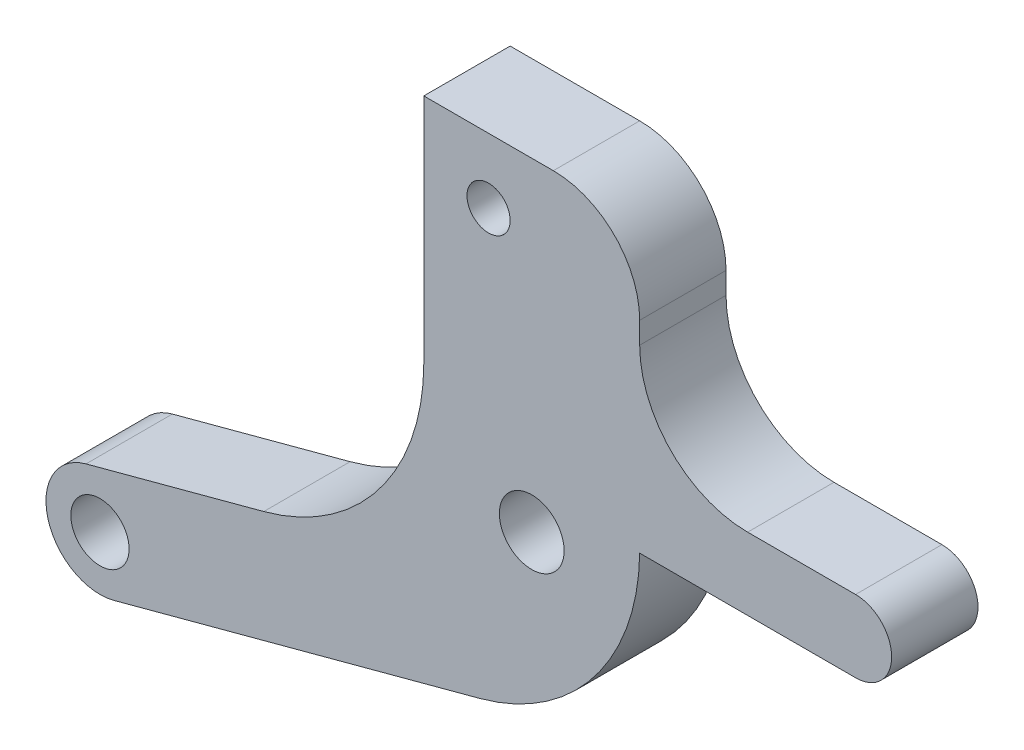
ISO-10303-21;
HEADER;
FILE_DESCRIPTION(('STEP AP214'),'2;1');
FILE_NAME('part.step','',(''),(''),'','','');
FILE_SCHEMA(('AUTOMOTIVE_DESIGN { 1 0 10303 214 1 1 1 1 }'));
ENDSEC;
DATA;
#1=APPLICATION_CONTEXT('core data for automotive mechanical design processes');
#2=APPLICATION_PROTOCOL_DEFINITION('international standard','automotive_design',2000,#1);
#3=PRODUCT_CONTEXT('',#1,'mechanical');
#4=PRODUCT('Part','Part','',(#3));
#5=PRODUCT_RELATED_PRODUCT_CATEGORY('part','',(#4));
#6=PRODUCT_DEFINITION_FORMATION('','',#4);
#7=PRODUCT_DEFINITION_CONTEXT('part definition',#1,'design');
#8=PRODUCT_DEFINITION('design','',#6,#7);
#9=PRODUCT_DEFINITION_SHAPE('','',#8);
#10=(LENGTH_UNIT() NAMED_UNIT(*) SI_UNIT(.MILLI.,.METRE.));
#11=(NAMED_UNIT(*) PLANE_ANGLE_UNIT() SI_UNIT($,.RADIAN.));
#12=(NAMED_UNIT(*) SI_UNIT($,.STERADIAN.) SOLID_ANGLE_UNIT());
#13=UNCERTAINTY_MEASURE_WITH_UNIT(LENGTH_MEASURE(1.E-05),#10,'distance_accuracy_value','');
#14=(GEOMETRIC_REPRESENTATION_CONTEXT(3) GLOBAL_UNCERTAINTY_ASSIGNED_CONTEXT((#13)) GLOBAL_UNIT_ASSIGNED_CONTEXT((#10,
#11,#12)) REPRESENTATION_CONTEXT('',''));
#15=CARTESIAN_POINT('',(0.,0.,0.));
#16=DIRECTION('',(0.,0.,1.));
#17=DIRECTION('',(1.,0.,0.));
#18=AXIS2_PLACEMENT_3D('',#15,#16,#17);
#19=CARTESIAN_POINT('',(15.,3.3293901031356,4.));
#20=DIRECTION('',(0.,0.,-1.));
#21=DIRECTION('',(-1.,0.,0.));
#22=AXIS2_PLACEMENT_3D('',#19,#20,#21);
#23=PLANE('',#22);
#24=CARTESIAN_POINT('',(-2.,12.,4.));
#25=DIRECTION('',(0.,0.,1.));
#26=DIRECTION('',(1.,0.,0.));
#27=AXIS2_PLACEMENT_3D('',#24,#25,#26);
#28=CIRCLE('',#27,1.);
#29=CARTESIAN_POINT('',(-1.,12.,4.));
#30=VERTEX_POINT('',#29);
#31=EDGE_CURVE('E427',#30,#30,#28,.T.);
#32=ORIENTED_EDGE('',*,*,#31,.F.);
#33=EDGE_LOOP('',(#32));
#34=FACE_BOUND('',#33,.T.);
#35=DIRECTION('',(0.,1.,0.));
#36=VECTOR('',#35,1.);
#37=CARTESIAN_POINT('',(5.,5.,4.));
#38=LINE('',#37,#36);
#39=CARTESIAN_POINT('',(5.,10.,4.));
#40=VERTEX_POINT('',#39);
#41=CARTESIAN_POINT('',(5.,11.,4.));
#42=VERTEX_POINT('',#41);
#43=EDGE_CURVE('E137',#40,#42,#38,.T.);
#44=ORIENTED_EDGE('',*,*,#43,.T.);
#45=CARTESIAN_POINT('',(0.999999999999999,11.,4.));
#46=DIRECTION('',(0.,0.,-1.));
#47=DIRECTION('',(-1.,0.,0.));
#48=AXIS2_PLACEMENT_3D('',#45,#46,#47);
#49=CIRCLE('',#48,4.);
#50=CARTESIAN_POINT('',(0.999999999999998,15.,4.));
#51=VERTEX_POINT('',#50);
#52=EDGE_CURVE('E11',#42,#51,#49,.F.);
#53=ORIENTED_EDGE('',*,*,#52,.T.);
#54=DIRECTION('',(-1.,0.,0.));
#55=VECTOR('',#54,1.);
#56=CARTESIAN_POINT('',(5.,15.,4.));
#57=LINE('',#56,#55);
#58=CARTESIAN_POINT('',(-5.,15.,4.));
#59=VERTEX_POINT('',#58);
#60=EDGE_CURVE('E191',#51,#59,#57,.T.);
#61=ORIENTED_EDGE('',*,*,#60,.T.);
#62=DIRECTION('',(0.,-1.,0.));
#63=VECTOR('',#62,1.);
#64=CARTESIAN_POINT('',(-5.,15.,4.));
#65=LINE('',#64,#63);
#66=CARTESIAN_POINT('',(-5.,4.28069821728162,4.));
#67=VERTEX_POINT('',#66);
#68=EDGE_CURVE('E256',#59,#67,#65,.T.);
#69=ORIENTED_EDGE('',*,*,#68,.T.);
#70=CARTESIAN_POINT('',(-15.,4.28069821728162,4.));
#71=DIRECTION('',(0.,0.,-1.));
#72=DIRECTION('',(-1.,0.,0.));
#73=AXIS2_PLACEMENT_3D('',#70,#71,#72);
#74=CIRCLE('',#73,10.);
#75=CARTESIAN_POINT('',(-12.4118095489748,-5.37856004560906,4.));
#76=VERTEX_POINT('',#75);
#77=EDGE_CURVE('E172',#67,#76,#74,.T.);
#78=ORIENTED_EDGE('',*,*,#77,.T.);
#79=DIRECTION('',(-0.965925826289069,-0.258819045102518,0.));
#80=VECTOR('',#79,1.);
#81=CARTESIAN_POINT('',(-5.,-3.392571662508,4.));
#82=LINE('',#81,#80);
#83=CARTESIAN_POINT('',(-20.6470476127563,-7.58518543427733,4.));
#84=VERTEX_POINT('',#83);
#85=EDGE_CURVE('E261',#76,#84,#82,.T.);
#86=ORIENTED_EDGE('',*,*,#85,.T.);
#87=CARTESIAN_POINT('',(-20.,-10.,4.));
#88=DIRECTION('',(0.,0.,1.));
#89=DIRECTION('',(1.,0.,0.));
#90=AXIS2_PLACEMENT_3D('',#87,#88,#89);
#91=CIRCLE('',#90,2.5);
#92=CARTESIAN_POINT('',(-19.3529523872437,-12.4148145657227,4.));
#93=VERTEX_POINT('',#92);
#94=EDGE_CURVE('E228',#84,#93,#91,.T.);
#95=ORIENTED_EDGE('',*,*,#94,.T.);
#96=DIRECTION('',(0.965925826289069,0.258819045102518,0.));
#97=VECTOR('',#96,1.);
#98=CARTESIAN_POINT('',(-19.3529523872437,-12.4148145657227,4.));
#99=LINE('',#98,#97);
#100=CARTESIAN_POINT('',(-2.41102527562674,-7.87523887793802,4.));
#101=VERTEX_POINT('',#100);
#102=EDGE_CURVE('E243',#93,#101,#99,.T.);
#103=ORIENTED_EDGE('',*,*,#102,.T.);
#104=CARTESIAN_POINT('',(-4.99921572665193,1.78401938495267,4.));
#105=DIRECTION('',(0.,0.,-1.));
#106=DIRECTION('',(-1.,0.,0.));
#107=AXIS2_PLACEMENT_3D('',#104,#105,#106);
#108=CIRCLE('',#107,10.);
#109=CARTESIAN_POINT('',(5.,1.65878020627119,4.));
#110=VERTEX_POINT('',#109);
#111=EDGE_CURVE('E163',#101,#110,#108,.F.);
#112=ORIENTED_EDGE('',*,*,#111,.T.);
#113=DIRECTION('',(1.,0.,0.));
#114=VECTOR('',#113,1.);
#115=CARTESIAN_POINT('',(5.,1.65878020627119,4.));
#116=LINE('',#115,#114);
#117=CARTESIAN_POINT('',(15.,1.65878020627119,4.));
#118=VERTEX_POINT('',#117);
#119=EDGE_CURVE('E143',#110,#118,#116,.T.);
#120=ORIENTED_EDGE('',*,*,#119,.T.);
#121=CARTESIAN_POINT('',(15.,3.3293901031356,4.));
#122=DIRECTION('',(0.,0.,1.));
#123=DIRECTION('',(-1.,0.,0.));
#124=AXIS2_PLACEMENT_3D('',#121,#122,#123);
#125=CIRCLE('',#124,1.6706098968644);
#126=CARTESIAN_POINT('',(15.,5.,4.));
#127=VERTEX_POINT('',#126);
#128=EDGE_CURVE('E138',#118,#127,#125,.T.);
#129=ORIENTED_EDGE('',*,*,#128,.T.);
#130=DIRECTION('',(-1.,0.,0.));
#131=VECTOR('',#130,1.);
#132=CARTESIAN_POINT('',(15.,5.,4.));
#133=LINE('',#132,#131);
#134=CARTESIAN_POINT('',(10.,5.,4.));
#135=VERTEX_POINT('',#134);
#136=EDGE_CURVE('E126',#127,#135,#133,.T.);
#137=ORIENTED_EDGE('',*,*,#136,.T.);
#138=CARTESIAN_POINT('',(10.,10.,4.));
#139=DIRECTION('',(0.,0.,-1.));
#140=DIRECTION('',(-1.,0.,0.));
#141=AXIS2_PLACEMENT_3D('',#138,#139,#140);
#142=CIRCLE('',#141,5.);
#143=EDGE_CURVE('E180',#135,#40,#142,.T.);
#144=ORIENTED_EDGE('',*,*,#143,.T.);
#145=EDGE_LOOP('',(#44,#53,#61,#69,#78,#86,#95,#103,#112,#120,#129,#137,#144));
#146=FACE_BOUND('',#145,.T.);
#147=CARTESIAN_POINT('',(0.,0.,4.));
#148=DIRECTION('',(0.,0.,1.));
#149=DIRECTION('',(1.,0.,0.));
#150=AXIS2_PLACEMENT_3D('',#147,#148,#149);
#151=CIRCLE('',#150,1.5);
#152=CARTESIAN_POINT('',(1.5,0.,4.));
#153=VERTEX_POINT('',#152);
#154=EDGE_CURVE('E250',#153,#153,#151,.T.);
#155=ORIENTED_EDGE('',*,*,#154,.F.);
#156=EDGE_LOOP('',(#155));
#157=FACE_BOUND('',#156,.T.);
#158=CARTESIAN_POINT('',(-20.,-10.,4.));
#159=DIRECTION('',(0.,0.,1.));
#160=DIRECTION('',(1.,0.,0.));
#161=AXIS2_PLACEMENT_3D('',#158,#159,#160);
#162=CIRCLE('',#161,1.35);
#163=CARTESIAN_POINT('',(-18.65,-10.,4.));
#164=VERTEX_POINT('',#163);
#165=EDGE_CURVE('E418',#164,#164,#162,.T.);
#166=ORIENTED_EDGE('',*,*,#165,.F.);
#167=EDGE_LOOP('',(#166));
#168=FACE_BOUND('',#167,.T.);
#169=ADVANCED_FACE('F31',(#34,#146,#157,#168),#23,.F.);
#170=CARTESIAN_POINT('',(15.,3.3293901031356,0.));
#171=DIRECTION('',(0.,0.,-1.));
#172=DIRECTION('',(-1.,0.,0.));
#173=AXIS2_PLACEMENT_3D('',#170,#171,#172);
#174=PLANE('',#173);
#175=CARTESIAN_POINT('',(-2.,12.,0.));
#176=DIRECTION('',(0.,0.,1.));
#177=DIRECTION('',(1.,0.,0.));
#178=AXIS2_PLACEMENT_3D('',#175,#176,#177);
#179=CIRCLE('',#178,1.);
#180=CARTESIAN_POINT('',(-1.,12.,0.));
#181=VERTEX_POINT('',#180);
#182=EDGE_CURVE('E424',#181,#181,#179,.T.);
#183=ORIENTED_EDGE('',*,*,#182,.T.);
#184=EDGE_LOOP('',(#183));
#185=FACE_BOUND('',#184,.T.);
#186=DIRECTION('',(-1.,0.,0.));
#187=VECTOR('',#186,1.);
#188=CARTESIAN_POINT('',(5.,15.,0.));
#189=LINE('',#188,#187);
#190=CARTESIAN_POINT('',(0.999999999999998,15.,0.));
#191=VERTEX_POINT('',#190);
#192=CARTESIAN_POINT('',(-5.,15.,0.));
#193=VERTEX_POINT('',#192);
#194=EDGE_CURVE('E190',#191,#193,#189,.T.);
#195=ORIENTED_EDGE('',*,*,#194,.F.);
#196=CARTESIAN_POINT('',(0.999999999999999,11.,0.));
#197=DIRECTION('',(0.,0.,-1.));
#198=DIRECTION('',(-1.,0.,0.));
#199=AXIS2_PLACEMENT_3D('',#196,#197,#198);
#200=CIRCLE('',#199,4.);
#201=CARTESIAN_POINT('',(5.,11.,0.));
#202=VERTEX_POINT('',#201);
#203=EDGE_CURVE('E53',#191,#202,#200,.T.);
#204=ORIENTED_EDGE('',*,*,#203,.T.);
#205=DIRECTION('',(0.,1.,0.));
#206=VECTOR('',#205,1.);
#207=CARTESIAN_POINT('',(5.,5.,0.));
#208=LINE('',#207,#206);
#209=CARTESIAN_POINT('',(5.,10.,0.));
#210=VERTEX_POINT('',#209);
#211=EDGE_CURVE('E199',#210,#202,#208,.T.);
#212=ORIENTED_EDGE('',*,*,#211,.F.);
#213=CARTESIAN_POINT('',(10.,10.,0.));
#214=DIRECTION('',(0.,0.,-1.));
#215=DIRECTION('',(-1.,0.,0.));
#216=AXIS2_PLACEMENT_3D('',#213,#214,#215);
#217=CIRCLE('',#216,5.);
#218=CARTESIAN_POINT('',(10.,5.,0.));
#219=VERTEX_POINT('',#218);
#220=EDGE_CURVE('E178',#210,#219,#217,.F.);
#221=ORIENTED_EDGE('',*,*,#220,.T.);
#222=DIRECTION('',(-1.,0.,0.));
#223=VECTOR('',#222,1.);
#224=CARTESIAN_POINT('',(15.,5.,0.));
#225=LINE('',#224,#223);
#226=CARTESIAN_POINT('',(15.,5.,0.));
#227=VERTEX_POINT('',#226);
#228=EDGE_CURVE('E203',#227,#219,#225,.T.);
#229=ORIENTED_EDGE('',*,*,#228,.F.);
#230=CARTESIAN_POINT('',(15.,3.3293901031356,0.));
#231=DIRECTION('',(0.,0.,1.));
#232=DIRECTION('',(-1.,0.,0.));
#233=AXIS2_PLACEMENT_3D('',#230,#231,#232);
#234=CIRCLE('',#233,1.6706098968644);
#235=CARTESIAN_POINT('',(15.,1.65878020627119,0.));
#236=VERTEX_POINT('',#235);
#237=EDGE_CURVE('E151',#236,#227,#234,.T.);
#238=ORIENTED_EDGE('',*,*,#237,.F.);
#239=DIRECTION('',(1.,0.,0.));
#240=VECTOR('',#239,1.);
#241=CARTESIAN_POINT('',(5.,1.65878020627119,0.));
#242=LINE('',#241,#240);
#243=CARTESIAN_POINT('',(5.,1.65878020627119,0.));
#244=VERTEX_POINT('',#243);
#245=EDGE_CURVE('E147',#244,#236,#242,.T.);
#246=ORIENTED_EDGE('',*,*,#245,.F.);
#247=CARTESIAN_POINT('',(-4.99921572665193,1.78401938495267,0.));
#248=DIRECTION('',(0.,0.,-1.));
#249=DIRECTION('',(-1.,0.,0.));
#250=AXIS2_PLACEMENT_3D('',#247,#248,#249);
#251=CIRCLE('',#250,10.);
#252=CARTESIAN_POINT('',(-2.41102527562674,-7.87523887793801,0.));
#253=VERTEX_POINT('',#252);
#254=EDGE_CURVE('E152',#244,#253,#251,.T.);
#255=ORIENTED_EDGE('',*,*,#254,.T.);
#256=DIRECTION('',(0.965925826289069,0.258819045102518,0.));
#257=VECTOR('',#256,1.);
#258=CARTESIAN_POINT('',(-19.3529523872437,-12.4148145657227,0.));
#259=LINE('',#258,#257);
#260=CARTESIAN_POINT('',(-19.3529523872437,-12.4148145657227,0.));
#261=VERTEX_POINT('',#260);
#262=EDGE_CURVE('E210',#261,#253,#259,.T.);
#263=ORIENTED_EDGE('',*,*,#262,.F.);
#264=CARTESIAN_POINT('',(-20.,-10.,0.));
#265=DIRECTION('',(0.,0.,1.));
#266=DIRECTION('',(1.,0.,0.));
#267=AXIS2_PLACEMENT_3D('',#264,#265,#266);
#268=CIRCLE('',#267,2.5);
#269=CARTESIAN_POINT('',(-20.6470476127563,-7.58518543427733,0.));
#270=VERTEX_POINT('',#269);
#271=EDGE_CURVE('E208',#270,#261,#268,.T.);
#272=ORIENTED_EDGE('',*,*,#271,.F.);
#273=DIRECTION('',(-0.965925826289069,-0.258819045102518,0.));
#274=VECTOR('',#273,1.);
#275=CARTESIAN_POINT('',(-5.,-3.392571662508,0.));
#276=LINE('',#275,#274);
#277=CARTESIAN_POINT('',(-12.4118095489748,-5.37856004560906,0.));
#278=VERTEX_POINT('',#277);
#279=EDGE_CURVE('E201',#278,#270,#276,.T.);
#280=ORIENTED_EDGE('',*,*,#279,.F.);
#281=CARTESIAN_POINT('',(-15.,4.28069821728162,0.));
#282=DIRECTION('',(0.,0.,-1.));
#283=DIRECTION('',(-1.,0.,0.));
#284=AXIS2_PLACEMENT_3D('',#281,#282,#283);
#285=CIRCLE('',#284,10.);
#286=CARTESIAN_POINT('',(-5.,4.28069821728162,0.));
#287=VERTEX_POINT('',#286);
#288=EDGE_CURVE('E170',#278,#287,#285,.F.);
#289=ORIENTED_EDGE('',*,*,#288,.T.);
#290=DIRECTION('',(0.,-1.,0.));
#291=VECTOR('',#290,1.);
#292=CARTESIAN_POINT('',(-5.,15.,0.));
#293=LINE('',#292,#291);
#294=EDGE_CURVE('E198',#193,#287,#293,.T.);
#295=ORIENTED_EDGE('',*,*,#294,.F.);
#296=EDGE_LOOP('',(#195,#204,#212,#221,#229,#238,#246,#255,#263,#272,#280,#289,#295));
#297=FACE_BOUND('',#296,.T.);
#298=CARTESIAN_POINT('',(0.,0.,0.));
#299=DIRECTION('',(0.,0.,1.));
#300=DIRECTION('',(1.,0.,0.));
#301=AXIS2_PLACEMENT_3D('',#298,#299,#300);
#302=CIRCLE('',#301,1.5);
#303=CARTESIAN_POINT('',(1.5,0.,0.));
#304=VERTEX_POINT('',#303);
#305=EDGE_CURVE('E430',#304,#304,#302,.T.);
#306=ORIENTED_EDGE('',*,*,#305,.T.);
#307=EDGE_LOOP('',(#306));
#308=FACE_BOUND('',#307,.T.);
#309=CARTESIAN_POINT('',(-20.,-10.,0.));
#310=DIRECTION('',(0.,0.,1.));
#311=DIRECTION('',(1.,0.,0.));
#312=AXIS2_PLACEMENT_3D('',#309,#310,#311);
#313=CIRCLE('',#312,1.35);
#314=CARTESIAN_POINT('',(-18.65,-10.,0.));
#315=VERTEX_POINT('',#314);
#316=EDGE_CURVE('E421',#315,#315,#313,.T.);
#317=ORIENTED_EDGE('',*,*,#316,.T.);
#318=EDGE_LOOP('',(#317));
#319=FACE_BOUND('',#318,.T.);
#320=ADVANCED_FACE('F195',(#185,#297,#308,#319),#174,.T.);
#321=CARTESIAN_POINT('',(15.,3.3293901031356,4.));
#322=DIRECTION('',(0.,0.,-1.));
#323=DIRECTION('',(-1.,0.,0.));
#324=AXIS2_PLACEMENT_3D('',#321,#322,#323);
#325=CYLINDRICAL_SURFACE('',#324,1.6706098968644);
#326=ORIENTED_EDGE('',*,*,#237,.T.);
#327=DIRECTION('',(0.,0.,-1.));
#328=VECTOR('',#327,1.);
#329=CARTESIAN_POINT('',(15.,5.,4.));
#330=LINE('',#329,#328);
#331=EDGE_CURVE('E131',#127,#227,#330,.T.);
#332=ORIENTED_EDGE('',*,*,#331,.F.);
#333=ORIENTED_EDGE('',*,*,#128,.F.);
#334=DIRECTION('',(0.,0.,-1.));
#335=VECTOR('',#334,1.);
#336=CARTESIAN_POINT('',(15.,1.65878020627119,4.));
#337=LINE('',#336,#335);
#338=EDGE_CURVE('E214',#118,#236,#337,.T.);
#339=ORIENTED_EDGE('',*,*,#338,.T.);
#340=EDGE_LOOP('',(#326,#332,#333,#339));
#341=FACE_BOUND('',#340,.T.);
#342=ADVANCED_FACE('F149',(#341),#325,.T.);
#343=CARTESIAN_POINT('',(15.,5.,4.));
#344=DIRECTION('',(0.,-1.,0.));
#345=DIRECTION('',(1.,0.,0.));
#346=AXIS2_PLACEMENT_3D('',#343,#344,#345);
#347=PLANE('',#346);
#348=ORIENTED_EDGE('',*,*,#228,.T.);
#349=DIRECTION('',(0.,0.,-1.));
#350=VECTOR('',#349,1.);
#351=CARTESIAN_POINT('',(10.,5.,4.));
#352=LINE('',#351,#350);
#353=EDGE_CURVE('E134',#219,#135,#352,.F.);
#354=ORIENTED_EDGE('',*,*,#353,.T.);
#355=ORIENTED_EDGE('',*,*,#136,.F.);
#356=ORIENTED_EDGE('',*,*,#331,.T.);
#357=EDGE_LOOP('',(#348,#354,#355,#356));
#358=FACE_BOUND('',#357,.T.);
#359=ADVANCED_FACE('F129',(#358),#347,.F.);
#360=CARTESIAN_POINT('',(5.,5.,4.));
#361=DIRECTION('',(-1.,0.,0.));
#362=DIRECTION('',(0.,-1.,0.));
#363=AXIS2_PLACEMENT_3D('',#360,#361,#362);
#364=PLANE('',#363);
#365=ORIENTED_EDGE('',*,*,#211,.T.);
#366=DIRECTION('',(0.,0.,-1.));
#367=VECTOR('',#366,1.);
#368=CARTESIAN_POINT('',(5.,11.,4.));
#369=LINE('',#368,#367);
#370=EDGE_CURVE('E39',#202,#42,#369,.F.);
#371=ORIENTED_EDGE('',*,*,#370,.T.);
#372=ORIENTED_EDGE('',*,*,#43,.F.);
#373=DIRECTION('',(0.,0.,-1.));
#374=VECTOR('',#373,1.);
#375=CARTESIAN_POINT('',(5.,10.,0.));
#376=LINE('',#375,#374);
#377=EDGE_CURVE('E174',#40,#210,#376,.T.);
#378=ORIENTED_EDGE('',*,*,#377,.T.);
#379=EDGE_LOOP('',(#365,#371,#372,#378));
#380=FACE_BOUND('',#379,.T.);
#381=ADVANCED_FACE('F254',(#380),#364,.F.);
#382=CARTESIAN_POINT('',(5.,15.,4.));
#383=DIRECTION('',(0.,-1.,0.));
#384=DIRECTION('',(1.,0.,0.));
#385=AXIS2_PLACEMENT_3D('',#382,#383,#384);
#386=PLANE('',#385);
#387=ORIENTED_EDGE('',*,*,#60,.F.);
#388=DIRECTION('',(0.,0.,-1.));
#389=VECTOR('',#388,1.);
#390=CARTESIAN_POINT('',(0.999999999999998,15.,4.));
#391=LINE('',#390,#389);
#392=EDGE_CURVE('E182',#51,#191,#391,.T.);
#393=ORIENTED_EDGE('',*,*,#392,.T.);
#394=ORIENTED_EDGE('',*,*,#194,.T.);
#395=DIRECTION('',(0.,0.,-1.));
#396=VECTOR('',#395,1.);
#397=CARTESIAN_POINT('',(-5.,15.,4.));
#398=LINE('',#397,#396);
#399=EDGE_CURVE('E153',#59,#193,#398,.T.);
#400=ORIENTED_EDGE('',*,*,#399,.F.);
#401=EDGE_LOOP('',(#387,#393,#394,#400));
#402=FACE_BOUND('',#401,.T.);
#403=ADVANCED_FACE('F188',(#402),#386,.F.);
#404=CARTESIAN_POINT('',(-5.,15.,4.));
#405=DIRECTION('',(1.,0.,0.));
#406=DIRECTION('',(0.,1.,0.));
#407=AXIS2_PLACEMENT_3D('',#404,#405,#406);
#408=PLANE('',#407);
#409=ORIENTED_EDGE('',*,*,#294,.T.);
#410=DIRECTION('',(0.,0.,-1.));
#411=VECTOR('',#410,1.);
#412=CARTESIAN_POINT('',(-5.,4.28069821728163,4.));
#413=LINE('',#412,#411);
#414=EDGE_CURVE('E168',#287,#67,#413,.F.);
#415=ORIENTED_EDGE('',*,*,#414,.T.);
#416=ORIENTED_EDGE('',*,*,#68,.F.);
#417=ORIENTED_EDGE('',*,*,#399,.T.);
#418=EDGE_LOOP('',(#409,#415,#416,#417));
#419=FACE_BOUND('',#418,.T.);
#420=ADVANCED_FACE('F269',(#419),#408,.F.);
#421=CARTESIAN_POINT('',(-5.,-3.392571662508,4.));
#422=DIRECTION('',(0.258819045102518,-0.965925826289069,0.));
#423=DIRECTION('',(0.965925826289069,0.258819045102518,0.));
#424=AXIS2_PLACEMENT_3D('',#421,#422,#423);
#425=PLANE('',#424);
#426=ORIENTED_EDGE('',*,*,#85,.F.);
#427=DIRECTION('',(0.,0.,-1.));
#428=VECTOR('',#427,1.);
#429=CARTESIAN_POINT('',(-12.4118095489748,-5.37856004560906,0.));
#430=LINE('',#429,#428);
#431=EDGE_CURVE('E165',#76,#278,#430,.T.);
#432=ORIENTED_EDGE('',*,*,#431,.T.);
#433=ORIENTED_EDGE('',*,*,#279,.T.);
#434=DIRECTION('',(0.,0.,-1.));
#435=VECTOR('',#434,1.);
#436=CARTESIAN_POINT('',(-20.6470476127563,-7.58518543427733,4.));
#437=LINE('',#436,#435);
#438=EDGE_CURVE('E158',#84,#270,#437,.T.);
#439=ORIENTED_EDGE('',*,*,#438,.F.);
#440=EDGE_LOOP('',(#426,#432,#433,#439));
#441=FACE_BOUND('',#440,.T.);
#442=ADVANCED_FACE('F264',(#441),#425,.F.);
#443=CARTESIAN_POINT('',(-20.,-10.,4.));
#444=DIRECTION('',(0.,0.,-1.));
#445=DIRECTION('',(-1.,0.,0.));
#446=AXIS2_PLACEMENT_3D('',#443,#444,#445);
#447=CYLINDRICAL_SURFACE('',#446,2.5);
#448=ORIENTED_EDGE('',*,*,#271,.T.);
#449=DIRECTION('',(0.,0.,-1.));
#450=VECTOR('',#449,1.);
#451=CARTESIAN_POINT('',(-19.3529523872437,-12.4148145657227,4.));
#452=LINE('',#451,#450);
#453=EDGE_CURVE('E219',#93,#261,#452,.T.);
#454=ORIENTED_EDGE('',*,*,#453,.F.);
#455=ORIENTED_EDGE('',*,*,#94,.F.);
#456=ORIENTED_EDGE('',*,*,#438,.T.);
#457=EDGE_LOOP('',(#448,#454,#455,#456));
#458=FACE_BOUND('',#457,.T.);
#459=ADVANCED_FACE('F226',(#458),#447,.T.);
#460=CARTESIAN_POINT('',(-19.3529523872437,-12.4148145657227,4.));
#461=DIRECTION('',(-0.258819045102518,0.965925826289069,0.));
#462=DIRECTION('',(-0.965925826289069,-0.258819045102518,0.));
#463=AXIS2_PLACEMENT_3D('',#460,#461,#462);
#464=PLANE('',#463);
#465=ORIENTED_EDGE('',*,*,#262,.T.);
#466=DIRECTION('',(0.,0.,-1.));
#467=VECTOR('',#466,1.);
#468=CARTESIAN_POINT('',(-2.41102527562674,-7.87523887793801,4.));
#469=LINE('',#468,#467);
#470=EDGE_CURVE('E155',#253,#101,#469,.F.);
#471=ORIENTED_EDGE('',*,*,#470,.T.);
#472=ORIENTED_EDGE('',*,*,#102,.F.);
#473=ORIENTED_EDGE('',*,*,#453,.T.);
#474=EDGE_LOOP('',(#465,#471,#472,#473));
#475=FACE_BOUND('',#474,.T.);
#476=ADVANCED_FACE('F236',(#475),#464,.F.);
#477=CARTESIAN_POINT('',(5.,1.65878020627119,4.));
#478=DIRECTION('',(0.,1.,0.));
#479=DIRECTION('',(-1.,0.,0.));
#480=AXIS2_PLACEMENT_3D('',#477,#478,#479);
#481=PLANE('',#480);
#482=ORIENTED_EDGE('',*,*,#245,.T.);
#483=ORIENTED_EDGE('',*,*,#338,.F.);
#484=ORIENTED_EDGE('',*,*,#119,.F.);
#485=DIRECTION('',(0.,0.,-1.));
#486=VECTOR('',#485,1.);
#487=CARTESIAN_POINT('',(5.,1.65878020627119,4.));
#488=LINE('',#487,#486);
#489=EDGE_CURVE('E216',#110,#244,#488,.T.);
#490=ORIENTED_EDGE('',*,*,#489,.T.);
#491=EDGE_LOOP('',(#482,#483,#484,#490));
#492=FACE_BOUND('',#491,.T.);
#493=ADVANCED_FACE('F245',(#492),#481,.F.);
#494=CARTESIAN_POINT('',(0.,0.,4.));
#495=DIRECTION('',(0.,0.,-1.));
#496=DIRECTION('',(-1.,0.,0.));
#497=AXIS2_PLACEMENT_3D('',#494,#495,#496);
#498=CYLINDRICAL_SURFACE('',#497,1.5);
#499=ORIENTED_EDGE('',*,*,#154,.T.);
#500=EDGE_LOOP('',(#499));
#501=FACE_BOUND('',#500,.T.);
#502=ORIENTED_EDGE('',*,*,#305,.F.);
#503=EDGE_LOOP('',(#502));
#504=FACE_BOUND('',#503,.T.);
#505=ADVANCED_FACE('F285',(#501,#504),#498,.F.);
#506=CARTESIAN_POINT('',(-2.,12.,4.));
#507=DIRECTION('',(0.,0.,-1.));
#508=DIRECTION('',(-1.,0.,0.));
#509=AXIS2_PLACEMENT_3D('',#506,#507,#508);
#510=CYLINDRICAL_SURFACE('',#509,1.);
#511=ORIENTED_EDGE('',*,*,#31,.T.);
#512=EDGE_LOOP('',(#511));
#513=FACE_BOUND('',#512,.T.);
#514=ORIENTED_EDGE('',*,*,#182,.F.);
#515=EDGE_LOOP('',(#514));
#516=FACE_BOUND('',#515,.T.);
#517=ADVANCED_FACE('F379',(#513,#516),#510,.F.);
#518=CARTESIAN_POINT('',(-20.,-10.,4.));
#519=DIRECTION('',(0.,0.,-1.));
#520=DIRECTION('',(-1.,0.,0.));
#521=AXIS2_PLACEMENT_3D('',#518,#519,#520);
#522=CYLINDRICAL_SURFACE('',#521,1.35);
#523=ORIENTED_EDGE('',*,*,#165,.T.);
#524=EDGE_LOOP('',(#523));
#525=FACE_BOUND('',#524,.T.);
#526=ORIENTED_EDGE('',*,*,#316,.F.);
#527=EDGE_LOOP('',(#526));
#528=FACE_BOUND('',#527,.T.);
#529=ADVANCED_FACE('F308',(#525,#528),#522,.F.);
#530=CARTESIAN_POINT('',(-4.99921572665193,1.78401938495267,4.));
#531=DIRECTION('',(0.,0.,-1.));
#532=DIRECTION('',(-1.,0.,0.));
#533=AXIS2_PLACEMENT_3D('',#530,#531,#532);
#534=CYLINDRICAL_SURFACE('',#533,10.);
#535=ORIENTED_EDGE('',*,*,#111,.F.);
#536=ORIENTED_EDGE('',*,*,#470,.F.);
#537=ORIENTED_EDGE('',*,*,#254,.F.);
#538=ORIENTED_EDGE('',*,*,#489,.F.);
#539=EDGE_LOOP('',(#535,#536,#537,#538));
#540=FACE_BOUND('',#539,.T.);
#541=ADVANCED_FACE('F241',(#540),#534,.T.);
#542=CARTESIAN_POINT('',(-15.,4.28069821728162,4.));
#543=DIRECTION('',(0.,0.,1.));
#544=DIRECTION('',(1.,0.,0.));
#545=AXIS2_PLACEMENT_3D('',#542,#543,#544);
#546=CYLINDRICAL_SURFACE('',#545,10.);
#547=ORIENTED_EDGE('',*,*,#77,.F.);
#548=ORIENTED_EDGE('',*,*,#414,.F.);
#549=ORIENTED_EDGE('',*,*,#288,.F.);
#550=ORIENTED_EDGE('',*,*,#431,.F.);
#551=EDGE_LOOP('',(#547,#548,#549,#550));
#552=FACE_BOUND('',#551,.T.);
#553=ADVANCED_FACE('F266',(#552),#546,.F.);
#554=CARTESIAN_POINT('',(10.,10.,4.));
#555=DIRECTION('',(0.,0.,1.));
#556=DIRECTION('',(1.,0.,0.));
#557=AXIS2_PLACEMENT_3D('',#554,#555,#556);
#558=CYLINDRICAL_SURFACE('',#557,5.);
#559=ORIENTED_EDGE('',*,*,#143,.F.);
#560=ORIENTED_EDGE('',*,*,#353,.F.);
#561=ORIENTED_EDGE('',*,*,#220,.F.);
#562=ORIENTED_EDGE('',*,*,#377,.F.);
#563=EDGE_LOOP('',(#559,#560,#561,#562));
#564=FACE_BOUND('',#563,.T.);
#565=ADVANCED_FACE('F252',(#564),#558,.F.);
#566=CARTESIAN_POINT('',(0.999999999999999,11.,4.));
#567=DIRECTION('',(0.,0.,-1.));
#568=DIRECTION('',(-1.,0.,0.));
#569=AXIS2_PLACEMENT_3D('',#566,#567,#568);
#570=CYLINDRICAL_SURFACE('',#569,4.);
#571=ORIENTED_EDGE('',*,*,#52,.F.);
#572=ORIENTED_EDGE('',*,*,#370,.F.);
#573=ORIENTED_EDGE('',*,*,#203,.F.);
#574=ORIENTED_EDGE('',*,*,#392,.F.);
#575=EDGE_LOOP('',(#571,#572,#573,#574));
#576=FACE_BOUND('',#575,.T.);
#577=ADVANCED_FACE('F33',(#576),#570,.T.);
#578=CLOSED_SHELL('',(#169,#320,#342,#359,#381,#403,#420,#442,#459,#476,#493,#505,#517,#529,
#541,#553,#565,#577));
#579=MANIFOLD_SOLID_BREP('B2',#578);
#580=ADVANCED_BREP_SHAPE_REPRESENTATION('',(#18,#579),#14);
#581=SHAPE_DEFINITION_REPRESENTATION(#9,#580);
ENDSEC;
END-ISO-10303-21;
